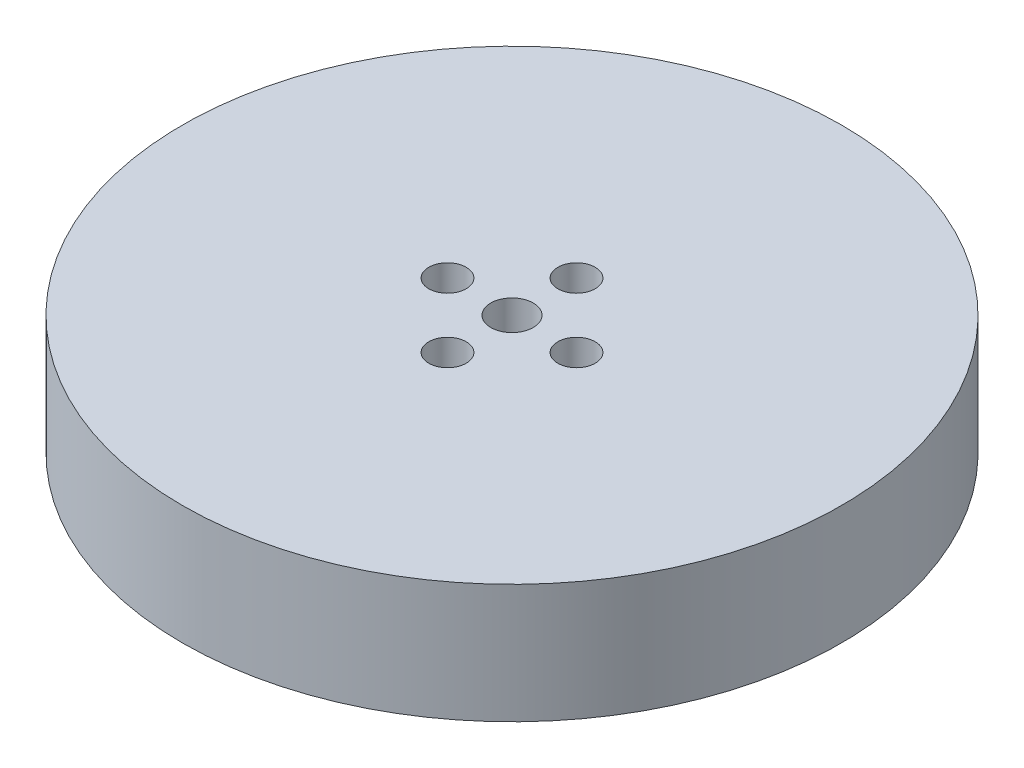
ISO-10303-21;
HEADER;
FILE_DESCRIPTION(('STEP AP214'),'2;1');
FILE_NAME('part.step','',(''),(''),'','','');
FILE_SCHEMA(('AUTOMOTIVE_DESIGN { 1 0 10303 214 1 1 1 1 }'));
ENDSEC;
DATA;
#1=APPLICATION_CONTEXT('core data for automotive mechanical design processes');
#2=APPLICATION_PROTOCOL_DEFINITION('international standard','automotive_design',2000,#1);
#3=PRODUCT_CONTEXT('',#1,'mechanical');
#4=PRODUCT('Part','Part','',(#3));
#5=PRODUCT_RELATED_PRODUCT_CATEGORY('part','',(#4));
#6=PRODUCT_DEFINITION_FORMATION('','',#4);
#7=PRODUCT_DEFINITION_CONTEXT('part definition',#1,'design');
#8=PRODUCT_DEFINITION('design','',#6,#7);
#9=PRODUCT_DEFINITION_SHAPE('','',#8);
#10=(LENGTH_UNIT() NAMED_UNIT(*) SI_UNIT(.MILLI.,.METRE.));
#11=(NAMED_UNIT(*) PLANE_ANGLE_UNIT() SI_UNIT($,.RADIAN.));
#12=(NAMED_UNIT(*) SI_UNIT($,.STERADIAN.) SOLID_ANGLE_UNIT());
#13=UNCERTAINTY_MEASURE_WITH_UNIT(LENGTH_MEASURE(1.E-05),#10,'distance_accuracy_value','');
#14=(GEOMETRIC_REPRESENTATION_CONTEXT(3) GLOBAL_UNCERTAINTY_ASSIGNED_CONTEXT((#13)) GLOBAL_UNIT_ASSIGNED_CONTEXT((#10,
#11,#12)) REPRESENTATION_CONTEXT('',''));
#15=CARTESIAN_POINT('',(0.,0.,0.));
#16=DIRECTION('',(0.,0.,1.));
#17=DIRECTION('',(1.,0.,0.));
#18=AXIS2_PLACEMENT_3D('',#15,#16,#17);
#19=CARTESIAN_POINT('',(0.,28.,0.));
#20=DIRECTION('',(0.,-1.,0.));
#21=DIRECTION('',(0.,0.,-1.));
#22=AXIS2_PLACEMENT_3D('',#19,#20,#21);
#23=CYLINDRICAL_SURFACE('',#22,77.5);
#24=CARTESIAN_POINT('',(0.,28.,0.));
#25=DIRECTION('',(0.,1.,0.));
#26=DIRECTION('',(0.,0.,1.));
#27=AXIS2_PLACEMENT_3D('',#24,#25,#26);
#28=CIRCLE('',#27,77.5);
#29=CARTESIAN_POINT('',(0.,28.,77.5));
#30=VERTEX_POINT('',#29);
#31=EDGE_CURVE('E10',#30,#30,#28,.T.);
#32=ORIENTED_EDGE('',*,*,#31,.F.);
#33=EDGE_LOOP('',(#32));
#34=FACE_BOUND('',#33,.T.);
#35=CARTESIAN_POINT('',(0.,0.,0.));
#36=DIRECTION('',(0.,1.,0.));
#37=DIRECTION('',(0.,0.,1.));
#38=AXIS2_PLACEMENT_3D('',#35,#36,#37);
#39=CIRCLE('',#38,77.5);
#40=CARTESIAN_POINT('',(0.,0.,77.5));
#41=VERTEX_POINT('',#40);
#42=EDGE_CURVE('E37',#41,#41,#39,.T.);
#43=ORIENTED_EDGE('',*,*,#42,.T.);
#44=EDGE_LOOP('',(#43));
#45=FACE_BOUND('',#44,.T.);
#46=ADVANCED_FACE('F40',(#34,#45),#23,.T.);
#47=CARTESIAN_POINT('',(0.,28.,0.));
#48=DIRECTION('',(0.,1.,0.));
#49=DIRECTION('',(0.,0.,1.));
#50=AXIS2_PLACEMENT_3D('',#47,#48,#49);
#51=PLANE('',#50);
#52=CARTESIAN_POINT('',(0.,28.,15.1703381667835));
#53=DIRECTION('',(0.,1.,0.));
#54=DIRECTION('',(1.,0.,0.));
#55=AXIS2_PLACEMENT_3D('',#52,#53,#54);
#56=CIRCLE('',#55,4.39381452456198);
#57=CARTESIAN_POINT('',(4.39381452456204,28.,15.1703381667834));
#58=VERTEX_POINT('',#57);
#59=EDGE_CURVE('E71',#58,#58,#56,.T.);
#60=ORIENTED_EDGE('',*,*,#59,.F.);
#61=EDGE_LOOP('',(#60));
#62=FACE_BOUND('',#61,.T.);
#63=CARTESIAN_POINT('',(15.1703381667835,28.,0.));
#64=DIRECTION('',(0.,1.,0.));
#65=DIRECTION('',(0.,0.,-1.));
#66=AXIS2_PLACEMENT_3D('',#63,#64,#65);
#67=CIRCLE('',#66,4.39381452456198);
#68=CARTESIAN_POINT('',(15.1703381667835,28.,-4.39381452456198));
#69=VERTEX_POINT('',#68);
#70=EDGE_CURVE('E70',#69,#69,#67,.T.);
#71=ORIENTED_EDGE('',*,*,#70,.F.);
#72=EDGE_LOOP('',(#71));
#73=FACE_BOUND('',#72,.T.);
#74=CARTESIAN_POINT('',(-1.58900857839793E-13,28.,-15.1703381667835));
#75=DIRECTION('',(0.,1.,0.));
#76=DIRECTION('',(-1.,0.,0.));
#77=AXIS2_PLACEMENT_3D('',#74,#75,#76);
#78=CIRCLE('',#77,4.39381452456198);
#79=CARTESIAN_POINT('',(-4.39381452456214,28.,-15.1703381667834));
#80=VERTEX_POINT('',#79);
#81=EDGE_CURVE('E61',#80,#80,#78,.T.);
#82=ORIENTED_EDGE('',*,*,#81,.F.);
#83=EDGE_LOOP('',(#82));
#84=FACE_BOUND('',#83,.T.);
#85=CARTESIAN_POINT('',(-15.1703381667835,28.,0.));
#86=DIRECTION('',(0.,1.,0.));
#87=DIRECTION('',(0.,0.,1.));
#88=AXIS2_PLACEMENT_3D('',#85,#86,#87);
#89=CIRCLE('',#88,4.39381452456198);
#90=CARTESIAN_POINT('',(-15.1703381667835,28.,4.39381452456198));
#91=VERTEX_POINT('',#90);
#92=EDGE_CURVE('E54',#91,#91,#89,.T.);
#93=ORIENTED_EDGE('',*,*,#92,.F.);
#94=EDGE_LOOP('',(#93));
#95=FACE_BOUND('',#94,.T.);
#96=CARTESIAN_POINT('',(0.,28.,0.));
#97=DIRECTION('',(0.,1.,0.));
#98=DIRECTION('',(0.,0.,1.));
#99=AXIS2_PLACEMENT_3D('',#96,#97,#98);
#100=CIRCLE('',#99,5.);
#101=CARTESIAN_POINT('',(0.,28.,5.));
#102=VERTEX_POINT('',#101);
#103=EDGE_CURVE('E50',#102,#102,#100,.T.);
#104=ORIENTED_EDGE('',*,*,#103,.F.);
#105=EDGE_LOOP('',(#104));
#106=FACE_BOUND('',#105,.T.);
#107=ORIENTED_EDGE('',*,*,#31,.T.);
#108=EDGE_LOOP('',(#107));
#109=FACE_BOUND('',#108,.T.);
#110=ADVANCED_FACE('F86',(#62,#73,#84,#95,#106,#109),#51,.T.);
#111=CARTESIAN_POINT('',(0.,0.,0.));
#112=DIRECTION('',(0.,1.,0.));
#113=DIRECTION('',(0.,0.,1.));
#114=AXIS2_PLACEMENT_3D('',#111,#112,#113);
#115=PLANE('',#114);
#116=CARTESIAN_POINT('',(0.,0.,0.));
#117=DIRECTION('',(0.,1.,0.));
#118=DIRECTION('',(0.,0.,1.));
#119=AXIS2_PLACEMENT_3D('',#116,#117,#118);
#120=CIRCLE('',#119,5.);
#121=CARTESIAN_POINT('',(0.,0.,5.));
#122=VERTEX_POINT('',#121);
#123=EDGE_CURVE('E47',#122,#122,#120,.T.);
#124=ORIENTED_EDGE('',*,*,#123,.T.);
#125=EDGE_LOOP('',(#124));
#126=FACE_BOUND('',#125,.T.);
#127=ORIENTED_EDGE('',*,*,#42,.F.);
#128=EDGE_LOOP('',(#127));
#129=FACE_BOUND('',#128,.T.);
#130=ADVANCED_FACE('F93',(#126,#129),#115,.F.);
#131=CARTESIAN_POINT('',(0.,28.,0.));
#132=DIRECTION('',(0.,-1.,0.));
#133=DIRECTION('',(0.,0.,-1.));
#134=AXIS2_PLACEMENT_3D('',#131,#132,#133);
#135=CYLINDRICAL_SURFACE('',#134,5.);
#136=ORIENTED_EDGE('',*,*,#103,.T.);
#137=EDGE_LOOP('',(#136));
#138=FACE_BOUND('',#137,.T.);
#139=ORIENTED_EDGE('',*,*,#123,.F.);
#140=EDGE_LOOP('',(#139));
#141=FACE_BOUND('',#140,.T.);
#142=ADVANCED_FACE('F101',(#138,#141),#135,.F.);
#143=CARTESIAN_POINT('',(-15.1703381667835,7.41023242415741,0.));
#144=DIRECTION('',(0.,1.,0.));
#145=DIRECTION('',(0.,0.,1.));
#146=AXIS2_PLACEMENT_3D('',#143,#144,#145);
#147=CYLINDRICAL_SURFACE('',#146,4.39381452456198);
#148=CARTESIAN_POINT('',(-15.1703381667835,7.41023242415741,0.));
#149=DIRECTION('',(0.,1.,0.));
#150=DIRECTION('',(0.,0.,1.));
#151=AXIS2_PLACEMENT_3D('',#148,#149,#150);
#152=CIRCLE('',#151,4.39381452456198);
#153=CARTESIAN_POINT('',(-15.1703381667835,7.41023242415741,4.39381452456198));
#154=VERTEX_POINT('',#153);
#155=EDGE_CURVE('E55',#154,#154,#152,.T.);
#156=ORIENTED_EDGE('',*,*,#155,.F.);
#157=EDGE_LOOP('',(#156));
#158=FACE_BOUND('',#157,.T.);
#159=ORIENTED_EDGE('',*,*,#92,.T.);
#160=EDGE_LOOP('',(#159));
#161=FACE_BOUND('',#160,.T.);
#162=ADVANCED_FACE('F102',(#158,#161),#147,.F.);
#163=CARTESIAN_POINT('',(-15.1703381667835,7.41023242415741,0.));
#164=DIRECTION('',(0.,1.,0.));
#165=DIRECTION('',(0.,0.,1.));
#166=AXIS2_PLACEMENT_3D('',#163,#164,#165);
#167=PLANE('',#166);
#168=ORIENTED_EDGE('',*,*,#155,.T.);
#169=EDGE_LOOP('',(#168));
#170=FACE_BOUND('',#169,.T.);
#171=ADVANCED_FACE('F133',(#170),#167,.T.);
#172=CARTESIAN_POINT('',(-1.58900857839793E-13,7.41023242415741,-15.1703381667835));
#173=DIRECTION('',(0.,1.,0.));
#174=DIRECTION('',(0.,0.,1.));
#175=AXIS2_PLACEMENT_3D('',#172,#173,#174);
#176=CYLINDRICAL_SURFACE('',#175,4.39381452456198);
#177=CARTESIAN_POINT('',(-1.58900857839793E-13,7.41023242415741,-15.1703381667835));
#178=DIRECTION('',(0.,1.,0.));
#179=DIRECTION('',(-1.,0.,0.));
#180=AXIS2_PLACEMENT_3D('',#177,#178,#179);
#181=CIRCLE('',#180,4.39381452456198);
#182=CARTESIAN_POINT('',(-4.39381452456214,7.41023242415741,-15.1703381667834));
#183=VERTEX_POINT('',#182);
#184=EDGE_CURVE('E63',#183,#183,#181,.T.);
#185=ORIENTED_EDGE('',*,*,#184,.F.);
#186=EDGE_LOOP('',(#185));
#187=FACE_BOUND('',#186,.T.);
#188=ORIENTED_EDGE('',*,*,#81,.T.);
#189=EDGE_LOOP('',(#188));
#190=FACE_BOUND('',#189,.T.);
#191=ADVANCED_FACE('F142',(#187,#190),#176,.F.);
#192=CARTESIAN_POINT('',(-1.58900857839793E-13,7.41023242415741,-15.1703381667835));
#193=DIRECTION('',(0.,1.,0.));
#194=DIRECTION('',(-1.,0.,0.));
#195=AXIS2_PLACEMENT_3D('',#192,#193,#194);
#196=PLANE('',#195);
#197=ORIENTED_EDGE('',*,*,#184,.T.);
#198=EDGE_LOOP('',(#197));
#199=FACE_BOUND('',#198,.T.);
#200=ADVANCED_FACE('F156',(#199),#196,.T.);
#201=CARTESIAN_POINT('',(15.1703381667835,7.41023242415741,0.));
#202=DIRECTION('',(0.,1.,0.));
#203=DIRECTION('',(0.,0.,1.));
#204=AXIS2_PLACEMENT_3D('',#201,#202,#203);
#205=CYLINDRICAL_SURFACE('',#204,4.39381452456198);
#206=CARTESIAN_POINT('',(15.1703381667835,7.41023242415741,0.));
#207=DIRECTION('',(0.,1.,0.));
#208=DIRECTION('',(0.,0.,-1.));
#209=AXIS2_PLACEMENT_3D('',#206,#207,#208);
#210=CIRCLE('',#209,4.39381452456198);
#211=CARTESIAN_POINT('',(15.1703381667835,7.41023242415741,-4.39381452456198));
#212=VERTEX_POINT('',#211);
#213=EDGE_CURVE('E69',#212,#212,#210,.T.);
#214=ORIENTED_EDGE('',*,*,#213,.F.);
#215=EDGE_LOOP('',(#214));
#216=FACE_BOUND('',#215,.T.);
#217=ORIENTED_EDGE('',*,*,#70,.T.);
#218=EDGE_LOOP('',(#217));
#219=FACE_BOUND('',#218,.T.);
#220=ADVANCED_FACE('F164',(#216,#219),#205,.F.);
#221=CARTESIAN_POINT('',(15.1703381667835,7.41023242415741,0.));
#222=DIRECTION('',(0.,1.,0.));
#223=DIRECTION('',(0.,0.,-1.));
#224=AXIS2_PLACEMENT_3D('',#221,#222,#223);
#225=PLANE('',#224);
#226=ORIENTED_EDGE('',*,*,#213,.T.);
#227=EDGE_LOOP('',(#226));
#228=FACE_BOUND('',#227,.T.);
#229=ADVANCED_FACE('F83',(#228),#225,.T.);
#230=CARTESIAN_POINT('',(0.,7.41023242415741,15.1703381667835));
#231=DIRECTION('',(0.,1.,0.));
#232=DIRECTION('',(0.,0.,1.));
#233=AXIS2_PLACEMENT_3D('',#230,#231,#232);
#234=CYLINDRICAL_SURFACE('',#233,4.39381452456198);
#235=CARTESIAN_POINT('',(0.,7.41023242415741,15.1703381667835));
#236=DIRECTION('',(0.,1.,0.));
#237=DIRECTION('',(1.,0.,0.));
#238=AXIS2_PLACEMENT_3D('',#235,#236,#237);
#239=CIRCLE('',#238,4.39381452456198);
#240=CARTESIAN_POINT('',(4.39381452456204,7.41023242415741,15.1703381667834));
#241=VERTEX_POINT('',#240);
#242=EDGE_CURVE('E59',#241,#241,#239,.T.);
#243=ORIENTED_EDGE('',*,*,#242,.F.);
#244=EDGE_LOOP('',(#243));
#245=FACE_BOUND('',#244,.T.);
#246=ORIENTED_EDGE('',*,*,#59,.T.);
#247=EDGE_LOOP('',(#246));
#248=FACE_BOUND('',#247,.T.);
#249=ADVANCED_FACE('F81',(#245,#248),#234,.F.);
#250=CARTESIAN_POINT('',(0.,7.41023242415741,15.1703381667835));
#251=DIRECTION('',(0.,1.,0.));
#252=DIRECTION('',(1.,0.,0.));
#253=AXIS2_PLACEMENT_3D('',#250,#251,#252);
#254=PLANE('',#253);
#255=ORIENTED_EDGE('',*,*,#242,.T.);
#256=EDGE_LOOP('',(#255));
#257=FACE_BOUND('',#256,.T.);
#258=ADVANCED_FACE('F78',(#257),#254,.T.);
#259=CLOSED_SHELL('',(#46,#110,#130,#142,#162,#171,#191,#200,#220,#229,#249,#258));
#260=MANIFOLD_SOLID_BREP('B2',#259);
#261=ADVANCED_BREP_SHAPE_REPRESENTATION('',(#18,#260),#14);
#262=SHAPE_DEFINITION_REPRESENTATION(#9,#261);
ENDSEC;
END-ISO-10303-21;
